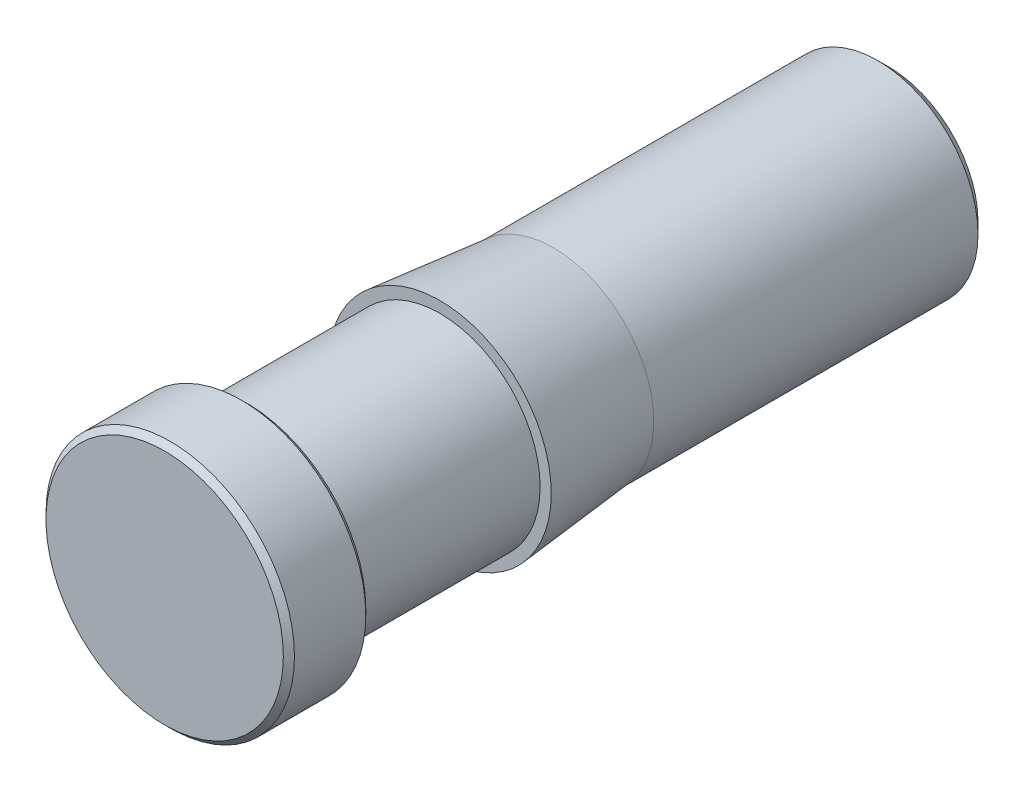
ISO-10303-21;
HEADER;
FILE_DESCRIPTION(('STEP AP214'),'2;1');
FILE_NAME('part.step','',(''),(''),'','','');
FILE_SCHEMA(('AUTOMOTIVE_DESIGN { 1 0 10303 214 1 1 1 1 }'));
ENDSEC;
DATA;
#1=APPLICATION_CONTEXT('core data for automotive mechanical design processes');
#2=APPLICATION_PROTOCOL_DEFINITION('international standard','automotive_design',2000,#1);
#3=PRODUCT_CONTEXT('',#1,'mechanical');
#4=PRODUCT('Part','Part','',(#3));
#5=PRODUCT_RELATED_PRODUCT_CATEGORY('part','',(#4));
#6=PRODUCT_DEFINITION_FORMATION('','',#4);
#7=PRODUCT_DEFINITION_CONTEXT('part definition',#1,'design');
#8=PRODUCT_DEFINITION('design','',#6,#7);
#9=PRODUCT_DEFINITION_SHAPE('','',#8);
#10=(LENGTH_UNIT() NAMED_UNIT(*) SI_UNIT(.MILLI.,.METRE.));
#11=(NAMED_UNIT(*) PLANE_ANGLE_UNIT() SI_UNIT($,.RADIAN.));
#12=(NAMED_UNIT(*) SI_UNIT($,.STERADIAN.) SOLID_ANGLE_UNIT());
#13=UNCERTAINTY_MEASURE_WITH_UNIT(LENGTH_MEASURE(1.E-05),#10,'distance_accuracy_value','');
#14=(GEOMETRIC_REPRESENTATION_CONTEXT(3) GLOBAL_UNCERTAINTY_ASSIGNED_CONTEXT((#13)) GLOBAL_UNIT_ASSIGNED_CONTEXT((#10,
#11,#12)) REPRESENTATION_CONTEXT('',''));
#15=CARTESIAN_POINT('',(0.,0.,0.));
#16=DIRECTION('',(0.,0.,1.));
#17=DIRECTION('',(1.,0.,0.));
#18=AXIS2_PLACEMENT_3D('',#15,#16,#17);
#19=CARTESIAN_POINT('',(0.,0.,-6.50000000001683));
#20=DIRECTION('',(0.,0.,1.));
#21=DIRECTION('',(1.,0.,0.));
#22=AXIS2_PLACEMENT_3D('',#19,#20,#21);
#23=CYLINDRICAL_SURFACE('',#22,0.650000000200541);
#24=CARTESIAN_POINT('',(0.,0.,-5.16999999964815));
#25=DIRECTION('',(0.,0.,1.));
#26=DIRECTION('',(1.,0.,0.));
#27=AXIS2_PLACEMENT_3D('',#24,#25,#26);
#28=CIRCLE('',#27,0.650000000200541);
#29=CARTESIAN_POINT('',(0.650000000200541,0.,-5.16999999964815));
#30=VERTEX_POINT('',#29);
#31=EDGE_CURVE('E11',#30,#30,#28,.T.);
#32=ORIENTED_EDGE('',*,*,#31,.T.);
#33=EDGE_LOOP('',(#32));
#34=FACE_BOUND('',#33,.T.);
#35=CARTESIAN_POINT('',(0.,0.,-6.44999999964814));
#36=DIRECTION('',(0.,0.,1.));
#37=DIRECTION('',(1.,0.,0.));
#38=AXIS2_PLACEMENT_3D('',#35,#36,#37);
#39=CIRCLE('',#38,0.65000000020054);
#40=CARTESIAN_POINT('',(0.65000000020054,0.,-6.44999999964814));
#41=VERTEX_POINT('',#40);
#42=EDGE_CURVE('E52',#41,#41,#39,.T.);
#43=ORIENTED_EDGE('',*,*,#42,.F.);
#44=EDGE_LOOP('',(#43));
#45=FACE_BOUND('',#44,.T.);
#46=ADVANCED_FACE('F33',(#34,#45),#23,.F.);
#47=CARTESIAN_POINT('',(0.,0.,-5.16999999964815));
#48=DIRECTION('',(0.,0.,-1.));
#49=DIRECTION('',(-1.,0.,0.));
#50=AXIS2_PLACEMENT_3D('',#47,#48,#49);
#51=CONICAL_SURFACE('',#50,0.650000000200541,1.0471975511966);
#52=CARTESIAN_POINT('',(0.,0.,-4.79472232455911));
#53=VERTEX_POINT('',#52);
#54=VERTEX_LOOP('',#53);
#55=FACE_BOUND('',#54,.T.);
#56=ORIENTED_EDGE('',*,*,#31,.F.);
#57=EDGE_LOOP('',(#56));
#58=FACE_BOUND('',#57,.T.);
#59=ADVANCED_FACE('F42',(#55,#58),#51,.F.);
#60=CARTESIAN_POINT('',(0.,0.,0.));
#61=DIRECTION('',(0.,0.,1.));
#62=DIRECTION('',(1.,0.,0.));
#63=AXIS2_PLACEMENT_3D('',#60,#61,#62);
#64=PLANE('',#63);
#65=CARTESIAN_POINT('',(0.,0.,0.));
#66=DIRECTION('',(0.,0.,1.));
#67=DIRECTION('',(1.,0.,0.));
#68=AXIS2_PLACEMENT_3D('',#65,#66,#67);
#69=CIRCLE('',#68,1.06500000003962);
#70=CARTESIAN_POINT('',(1.06500000003962,0.,0.));
#71=VERTEX_POINT('',#70);
#72=EDGE_CURVE('E39',#71,#71,#69,.T.);
#73=ORIENTED_EDGE('',*,*,#72,.T.);
#74=EDGE_LOOP('',(#73));
#75=FACE_BOUND('',#74,.T.);
#76=ADVANCED_FACE('F45',(#75),#64,.T.);
#77=CARTESIAN_POINT('',(0.,0.,0.));
#78=DIRECTION('',(0.,0.,-1.));
#79=DIRECTION('',(-1.,0.,0.));
#80=AXIS2_PLACEMENT_3D('',#77,#78,#79);
#81=CONICAL_SURFACE('',#80,1.06500000003962,0.785398163397455);
#82=CARTESIAN_POINT('',(0.,0.,-0.0499999999603803));
#83=DIRECTION('',(0.,0.,1.));
#84=DIRECTION('',(1.,0.,0.));
#85=AXIS2_PLACEMENT_3D('',#82,#83,#84);
#86=CIRCLE('',#85,1.115);
#87=CARTESIAN_POINT('',(1.115,0.,-0.0499999999603803));
#88=VERTEX_POINT('',#87);
#89=EDGE_CURVE('E83',#88,#88,#86,.T.);
#90=ORIENTED_EDGE('',*,*,#89,.T.);
#91=EDGE_LOOP('',(#90));
#92=FACE_BOUND('',#91,.T.);
#93=ORIENTED_EDGE('',*,*,#72,.F.);
#94=EDGE_LOOP('',(#93));
#95=FACE_BOUND('',#94,.T.);
#96=ADVANCED_FACE('F89',(#92,#95),#81,.T.);
#97=CARTESIAN_POINT('',(0.,0.,-6.50000000001683));
#98=DIRECTION('',(0.,0.,1.));
#99=DIRECTION('',(1.,0.,0.));
#100=AXIS2_PLACEMENT_3D('',#97,#98,#99);
#101=CYLINDRICAL_SURFACE('',#100,1.115);
#102=CARTESIAN_POINT('',(0.,0.,-0.690000000000002));
#103=DIRECTION('',(0.,0.,1.));
#104=DIRECTION('',(1.,0.,0.));
#105=AXIS2_PLACEMENT_3D('',#102,#103,#104);
#106=CIRCLE('',#105,1.115);
#107=CARTESIAN_POINT('',(1.115,0.,-0.690000000000002));
#108=VERTEX_POINT('',#107);
#109=EDGE_CURVE('E80',#108,#108,#106,.T.);
#110=ORIENTED_EDGE('',*,*,#109,.T.);
#111=EDGE_LOOP('',(#110));
#112=FACE_BOUND('',#111,.T.);
#113=ORIENTED_EDGE('',*,*,#89,.F.);
#114=EDGE_LOOP('',(#113));
#115=FACE_BOUND('',#114,.T.);
#116=ADVANCED_FACE('F91',(#112,#115),#101,.T.);
#117=CARTESIAN_POINT('',(0.,0.,-0.690000000000002));
#118=DIRECTION('',(0.,0.,1.));
#119=DIRECTION('',(1.,0.,0.));
#120=AXIS2_PLACEMENT_3D('',#117,#118,#119);
#121=CONICAL_SURFACE('',#120,1.115,0.785398163397448);
#122=CARTESIAN_POINT('',(0.,0.,-0.739999999983948));
#123=DIRECTION('',(0.,0.,1.));
#124=DIRECTION('',(1.,0.,0.));
#125=AXIS2_PLACEMENT_3D('',#122,#123,#124);
#126=CIRCLE('',#125,1.06500000001605);
#127=CARTESIAN_POINT('',(1.06500000001605,0.,-0.739999999983948));
#128=VERTEX_POINT('',#127);
#129=EDGE_CURVE('E77',#128,#128,#126,.T.);
#130=ORIENTED_EDGE('',*,*,#129,.T.);
#131=EDGE_LOOP('',(#130));
#132=FACE_BOUND('',#131,.T.);
#133=ORIENTED_EDGE('',*,*,#109,.F.);
#134=EDGE_LOOP('',(#133));
#135=FACE_BOUND('',#134,.T.);
#136=ADVANCED_FACE('F98',(#132,#135),#121,.T.);
#137=CARTESIAN_POINT('',(1.06500000001605,0.,-0.739999999983948));
#138=DIRECTION('',(0.,0.,-1.));
#139=DIRECTION('',(-1.,0.,0.));
#140=AXIS2_PLACEMENT_3D('',#137,#138,#139);
#141=PLANE('',#140);
#142=CARTESIAN_POINT('',(0.,0.,-0.739999999983948));
#143=DIRECTION('',(0.,0.,1.));
#144=DIRECTION('',(1.,0.,0.));
#145=AXIS2_PLACEMENT_3D('',#142,#143,#144);
#146=CIRCLE('',#145,0.900000000146291);
#147=CARTESIAN_POINT('',(0.900000000146291,0.,-0.739999999983948));
#148=VERTEX_POINT('',#147);
#149=EDGE_CURVE('E74',#148,#148,#146,.T.);
#150=ORIENTED_EDGE('',*,*,#149,.T.);
#151=EDGE_LOOP('',(#150));
#152=FACE_BOUND('',#151,.T.);
#153=ORIENTED_EDGE('',*,*,#129,.F.);
#154=EDGE_LOOP('',(#153));
#155=FACE_BOUND('',#154,.T.);
#156=ADVANCED_FACE('F105',(#152,#155),#141,.T.);
#157=CARTESIAN_POINT('',(0.,0.,-6.50000000001683));
#158=DIRECTION('',(0.,0.,1.));
#159=DIRECTION('',(1.,0.,0.));
#160=AXIS2_PLACEMENT_3D('',#157,#158,#159);
#161=CYLINDRICAL_SURFACE('',#160,0.900000000146291);
#162=CARTESIAN_POINT('',(0.,0.,-2.46999999966218));
#163=DIRECTION('',(0.,0.,1.));
#164=DIRECTION('',(1.,0.,0.));
#165=AXIS2_PLACEMENT_3D('',#162,#163,#164);
#166=CIRCLE('',#165,0.900000000146291);
#167=CARTESIAN_POINT('',(0.900000000146291,0.,-2.46999999966218));
#168=VERTEX_POINT('',#167);
#169=EDGE_CURVE('E71',#168,#168,#166,.T.);
#170=ORIENTED_EDGE('',*,*,#169,.T.);
#171=EDGE_LOOP('',(#170));
#172=FACE_BOUND('',#171,.T.);
#173=ORIENTED_EDGE('',*,*,#149,.F.);
#174=EDGE_LOOP('',(#173));
#175=FACE_BOUND('',#174,.T.);
#176=ADVANCED_FACE('F109',(#172,#175),#161,.T.);
#177=CARTESIAN_POINT('',(0.900000000146291,0.,-2.46999999966218));
#178=DIRECTION('',(0.,0.,1.));
#179=DIRECTION('',(1.,0.,0.));
#180=AXIS2_PLACEMENT_3D('',#177,#178,#179);
#181=PLANE('',#180);
#182=CARTESIAN_POINT('',(0.,0.,-2.46999999966218));
#183=DIRECTION('',(0.,0.,1.));
#184=DIRECTION('',(1.,0.,0.));
#185=AXIS2_PLACEMENT_3D('',#182,#183,#184);
#186=CIRCLE('',#185,1.00000000013226);
#187=CARTESIAN_POINT('',(1.00000000013226,0.,-2.46999999966218));
#188=VERTEX_POINT('',#187);
#189=EDGE_CURVE('E68',#188,#188,#186,.T.);
#190=ORIENTED_EDGE('',*,*,#189,.T.);
#191=EDGE_LOOP('',(#190));
#192=FACE_BOUND('',#191,.T.);
#193=ORIENTED_EDGE('',*,*,#169,.F.);
#194=EDGE_LOOP('',(#193));
#195=FACE_BOUND('',#194,.T.);
#196=ADVANCED_FACE('F113',(#192,#195),#181,.T.);
#197=CARTESIAN_POINT('',(0.,0.,-2.46999999966218));
#198=DIRECTION('',(0.,0.,1.));
#199=DIRECTION('',(1.,0.,0.));
#200=AXIS2_PLACEMENT_3D('',#197,#198,#199);
#201=CONICAL_SURFACE('',#200,1.00000000013226,0.0977269073466748);
#202=CARTESIAN_POINT('',(0.,0.,-3.48999999964555));
#203=DIRECTION('',(0.,0.,1.));
#204=DIRECTION('',(1.,0.,0.));
#205=AXIS2_PLACEMENT_3D('',#202,#203,#204);
#206=CIRCLE('',#205,0.900000000146291);
#207=CARTESIAN_POINT('',(0.900000000146291,0.,-3.48999999964555));
#208=VERTEX_POINT('',#207);
#209=EDGE_CURVE('E65',#208,#208,#206,.T.);
#210=ORIENTED_EDGE('',*,*,#209,.T.);
#211=EDGE_LOOP('',(#210));
#212=FACE_BOUND('',#211,.T.);
#213=ORIENTED_EDGE('',*,*,#189,.F.);
#214=EDGE_LOOP('',(#213));
#215=FACE_BOUND('',#214,.T.);
#216=ADVANCED_FACE('F117',(#212,#215),#201,.T.);
#217=CARTESIAN_POINT('',(0.,0.,-6.50000000001683));
#218=DIRECTION('',(0.,0.,1.));
#219=DIRECTION('',(1.,0.,0.));
#220=AXIS2_PLACEMENT_3D('',#217,#218,#219);
#221=CYLINDRICAL_SURFACE('',#220,0.900000000146291);
#222=CARTESIAN_POINT('',(0.,0.,-6.39999999968893));
#223=DIRECTION('',(0.,0.,1.));
#224=DIRECTION('',(1.,0.,0.));
#225=AXIS2_PLACEMENT_3D('',#222,#223,#224);
#226=CIRCLE('',#225,0.900000000146291);
#227=CARTESIAN_POINT('',(0.900000000146291,0.,-6.39999999968893));
#228=VERTEX_POINT('',#227);
#229=EDGE_CURVE('E62',#228,#228,#226,.T.);
#230=ORIENTED_EDGE('',*,*,#229,.T.);
#231=EDGE_LOOP('',(#230));
#232=FACE_BOUND('',#231,.T.);
#233=ORIENTED_EDGE('',*,*,#209,.F.);
#234=EDGE_LOOP('',(#233));
#235=FACE_BOUND('',#234,.T.);
#236=ADVANCED_FACE('F121',(#232,#235),#221,.T.);
#237=CARTESIAN_POINT('',(0.,0.,-6.39999999968893));
#238=DIRECTION('',(0.,0.,1.));
#239=DIRECTION('',(1.,0.,0.));
#240=AXIS2_PLACEMENT_3D('',#237,#238,#239);
#241=CONICAL_SURFACE('',#240,0.900000000146291,0.785398163397445);
#242=CARTESIAN_POINT('',(0.,0.,-6.49999999968238));
#243=DIRECTION('',(0.,0.,1.));
#244=DIRECTION('',(1.,0.,0.));
#245=AXIS2_PLACEMENT_3D('',#242,#243,#244);
#246=CIRCLE('',#245,0.800000000152838);
#247=CARTESIAN_POINT('',(0.800000000152838,0.,-6.49999999968238));
#248=VERTEX_POINT('',#247);
#249=EDGE_CURVE('E57',#248,#248,#246,.T.);
#250=ORIENTED_EDGE('',*,*,#249,.T.);
#251=EDGE_LOOP('',(#250));
#252=FACE_BOUND('',#251,.T.);
#253=ORIENTED_EDGE('',*,*,#229,.F.);
#254=EDGE_LOOP('',(#253));
#255=FACE_BOUND('',#254,.T.);
#256=ADVANCED_FACE('F125',(#252,#255),#241,.T.);
#257=CARTESIAN_POINT('',(0.800000000152838,0.,-6.49999999968238));
#258=DIRECTION('',(0.,0.,-1.));
#259=DIRECTION('',(-1.,0.,0.));
#260=AXIS2_PLACEMENT_3D('',#257,#258,#259);
#261=PLANE('',#260);
#262=CARTESIAN_POINT('',(0.,0.,-6.49999999968238));
#263=DIRECTION('',(0.,0.,1.));
#264=DIRECTION('',(1.,0.,0.));
#265=AXIS2_PLACEMENT_3D('',#262,#263,#264);
#266=CIRCLE('',#265,0.700000000234783);
#267=CARTESIAN_POINT('',(0.700000000234783,0.,-6.49999999968238));
#268=VERTEX_POINT('',#267);
#269=EDGE_CURVE('E54',#268,#268,#266,.T.);
#270=ORIENTED_EDGE('',*,*,#269,.T.);
#271=EDGE_LOOP('',(#270));
#272=FACE_BOUND('',#271,.T.);
#273=ORIENTED_EDGE('',*,*,#249,.F.);
#274=EDGE_LOOP('',(#273));
#275=FACE_BOUND('',#274,.T.);
#276=ADVANCED_FACE('F129',(#272,#275),#261,.T.);
#277=CARTESIAN_POINT('',(0.,0.,-6.49999999968238));
#278=DIRECTION('',(0.,0.,-1.));
#279=DIRECTION('',(-1.,0.,0.));
#280=AXIS2_PLACEMENT_3D('',#277,#278,#279);
#281=CONICAL_SURFACE('',#280,0.700000000234783,0.78539816339745);
#282=ORIENTED_EDGE('',*,*,#42,.T.);
#283=EDGE_LOOP('',(#282));
#284=FACE_BOUND('',#283,.T.);
#285=ORIENTED_EDGE('',*,*,#269,.F.);
#286=EDGE_LOOP('',(#285));
#287=FACE_BOUND('',#286,.T.);
#288=ADVANCED_FACE('F133',(#284,#287),#281,.F.);
#289=CLOSED_SHELL('',(#46,#59,#76,#96,#116,#136,#156,#176,#196,#216,#236,#256,#276,#288));
#290=MANIFOLD_SOLID_BREP('B2',#289);
#291=ADVANCED_BREP_SHAPE_REPRESENTATION('',(#18,#290),#14);
#292=SHAPE_DEFINITION_REPRESENTATION(#9,#291);
ENDSEC;
END-ISO-10303-21;
